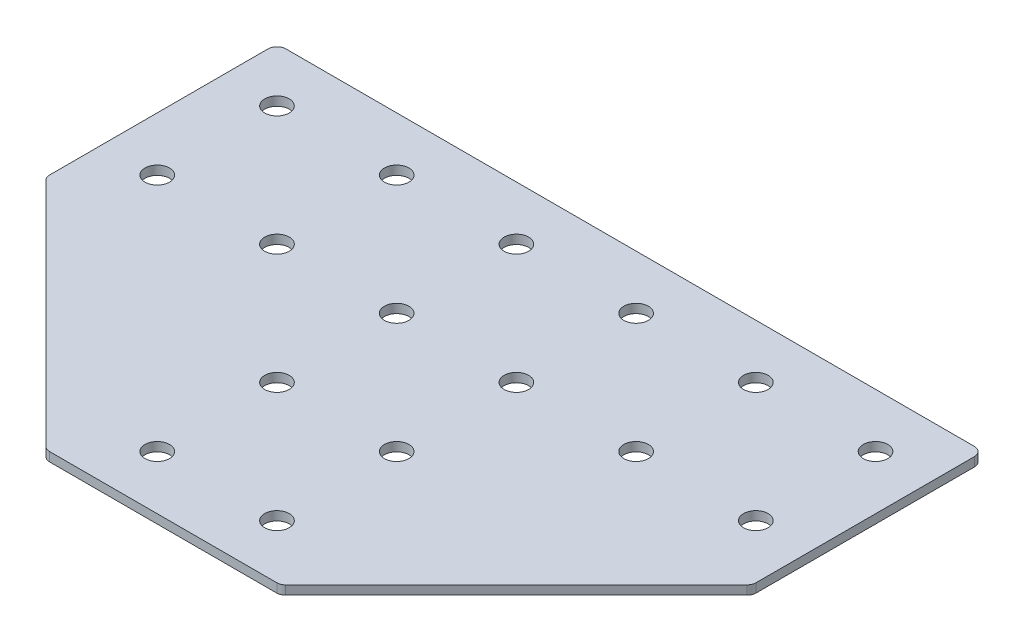
ISO-10303-21;
HEADER;
FILE_DESCRIPTION(('STEP AP214'),'2;1');
FILE_NAME('part.step','',(''),(''),'','','');
FILE_SCHEMA(('AUTOMOTIVE_DESIGN { 1 0 10303 214 1 1 1 1 }'));
ENDSEC;
DATA;
#1=APPLICATION_CONTEXT('core data for automotive mechanical design processes');
#2=APPLICATION_PROTOCOL_DEFINITION('international standard','automotive_design',2000,#1);
#3=PRODUCT_CONTEXT('',#1,'mechanical');
#4=PRODUCT('Part','Part','',(#3));
#5=PRODUCT_RELATED_PRODUCT_CATEGORY('part','',(#4));
#6=PRODUCT_DEFINITION_FORMATION('','',#4);
#7=PRODUCT_DEFINITION_CONTEXT('part definition',#1,'design');
#8=PRODUCT_DEFINITION('design','',#6,#7);
#9=PRODUCT_DEFINITION_SHAPE('','',#8);
#10=(LENGTH_UNIT() NAMED_UNIT(*) SI_UNIT(.MILLI.,.METRE.));
#11=(NAMED_UNIT(*) PLANE_ANGLE_UNIT() SI_UNIT($,.RADIAN.));
#12=(NAMED_UNIT(*) SI_UNIT($,.STERADIAN.) SOLID_ANGLE_UNIT());
#13=UNCERTAINTY_MEASURE_WITH_UNIT(LENGTH_MEASURE(1.E-05),#10,'distance_accuracy_value','');
#14=(GEOMETRIC_REPRESENTATION_CONTEXT(3) GLOBAL_UNCERTAINTY_ASSIGNED_CONTEXT((#13)) GLOBAL_UNIT_ASSIGNED_CONTEXT((#10,
#11,#12)) REPRESENTATION_CONTEXT('',''));
#15=CARTESIAN_POINT('',(0.,0.,0.));
#16=DIRECTION('',(0.,0.,1.));
#17=DIRECTION('',(1.,0.,0.));
#18=AXIS2_PLACEMENT_3D('',#15,#16,#17);
#19=CARTESIAN_POINT('',(36.9589307575042,3.99134831022957,73.4790580013509));
#20=DIRECTION('',(0.,-1.,0.));
#21=DIRECTION('',(0.,0.,-1.));
#22=AXIS2_PLACEMENT_3D('',#19,#20,#21);
#23=CYLINDRICAL_SURFACE('',#22,3.);
#24=CARTESIAN_POINT('',(36.9589307575042,0.991348310229569,73.4790580013509));
#25=DIRECTION('',(0.,-1.,0.));
#26=DIRECTION('',(0.,0.,-1.));
#27=AXIS2_PLACEMENT_3D('',#24,#25,#26);
#28=CIRCLE('',#27,3.);
#29=CARTESIAN_POINT('',(39.0802511010639,0.991348310229569,75.6003783449106));
#30=VERTEX_POINT('',#29);
#31=CARTESIAN_POINT('',(36.9589307575042,0.991348310229569,76.4790580013509));
#32=VERTEX_POINT('',#31);
#33=EDGE_CURVE('E169',#30,#32,#28,.T.);
#34=ORIENTED_EDGE('',*,*,#33,.F.);
#35=DIRECTION('',(0.,-1.,0.));
#36=VECTOR('',#35,1.);
#37=CARTESIAN_POINT('',(39.0802511010639,3.99134831022957,75.6003783449106));
#38=LINE('',#37,#36);
#39=CARTESIAN_POINT('',(39.0802511010639,3.99134831022957,75.6003783449106));
#40=VERTEX_POINT('',#39);
#41=EDGE_CURVE('E11',#40,#30,#38,.T.);
#42=ORIENTED_EDGE('',*,*,#41,.F.);
#43=CARTESIAN_POINT('',(36.9589307575042,3.99134831022957,73.4790580013509));
#44=DIRECTION('',(0.,-1.,0.));
#45=DIRECTION('',(0.,0.,-1.));
#46=AXIS2_PLACEMENT_3D('',#43,#44,#45);
#47=CIRCLE('',#46,3.);
#48=CARTESIAN_POINT('',(36.9589307575042,3.99134831022957,76.4790580013509));
#49=VERTEX_POINT('',#48);
#50=EDGE_CURVE('E214',#40,#49,#47,.T.);
#51=ORIENTED_EDGE('',*,*,#50,.T.);
#52=DIRECTION('',(0.,-1.,0.));
#53=VECTOR('',#52,1.);
#54=CARTESIAN_POINT('',(36.9589307575042,3.99134831022957,76.4790580013509));
#55=LINE('',#54,#53);
#56=EDGE_CURVE('E44',#49,#32,#55,.T.);
#57=ORIENTED_EDGE('',*,*,#56,.T.);
#58=EDGE_LOOP('',(#34,#42,#51,#57));
#59=FACE_BOUND('',#58,.T.);
#60=ADVANCED_FACE('F41',(#59),#23,.T.);
#61=CARTESIAN_POINT('',(116.151318912929,3.99134831022957,-1.47068946695478));
#62=DIRECTION('',(0.707106781186548,0.,0.707106781186547));
#63=DIRECTION('',(0.707106781186547,0.,-0.707106781186548));
#64=AXIS2_PLACEMENT_3D('',#61,#62,#63);
#65=PLANE('',#64);
#66=DIRECTION('',(-0.707106781186547,0.,0.707106781186548));
#67=VECTOR('',#66,1.);
#68=CARTESIAN_POINT('',(116.151318912929,0.991348310229569,-1.47068946695478));
#69=LINE('',#68,#67);
#70=CARTESIAN_POINT('',(116.151318912929,0.991348310229569,-1.47068946695478));
#71=VERTEX_POINT('',#70);
#72=EDGE_CURVE('E211',#71,#30,#69,.T.);
#73=ORIENTED_EDGE('',*,*,#72,.F.);
#74=DIRECTION('',(0.,-1.,0.));
#75=VECTOR('',#74,1.);
#76=CARTESIAN_POINT('',(116.151318912929,3.99134831022957,-1.47068946695478));
#77=LINE('',#76,#75);
#78=CARTESIAN_POINT('',(116.151318912929,3.99134831022957,-1.47068946695478));
#79=VERTEX_POINT('',#78);
#80=EDGE_CURVE('E51',#79,#71,#77,.T.);
#81=ORIENTED_EDGE('',*,*,#80,.F.);
#82=DIRECTION('',(-0.707106781186547,0.,0.707106781186548));
#83=VECTOR('',#82,1.);
#84=CARTESIAN_POINT('',(116.151318912929,3.99134831022957,-1.47068946695478));
#85=LINE('',#84,#83);
#86=EDGE_CURVE('E154',#79,#40,#85,.T.);
#87=ORIENTED_EDGE('',*,*,#86,.T.);
#88=ORIENTED_EDGE('',*,*,#41,.T.);
#89=EDGE_LOOP('',(#73,#81,#87,#88));
#90=FACE_BOUND('',#89,.T.);
#91=ADVANCED_FACE('F246',(#90),#65,.T.);
#92=CARTESIAN_POINT('',(114.029998569369,3.99134831022957,-3.5920098105144));
#93=DIRECTION('',(0.,-1.,0.));
#94=DIRECTION('',(0.,0.,-1.));
#95=AXIS2_PLACEMENT_3D('',#92,#93,#94);
#96=CYLINDRICAL_SURFACE('',#95,3.);
#97=CARTESIAN_POINT('',(114.029998569369,0.991348310229569,-3.5920098105144));
#98=DIRECTION('',(0.,-1.,0.));
#99=DIRECTION('',(0.,0.,-1.));
#100=AXIS2_PLACEMENT_3D('',#97,#98,#99);
#101=CIRCLE('',#100,3.);
#102=CARTESIAN_POINT('',(117.029998569369,0.991348310229569,-3.5920098105144));
#103=VERTEX_POINT('',#102);
#104=EDGE_CURVE('E140',#103,#71,#101,.T.);
#105=ORIENTED_EDGE('',*,*,#104,.F.);
#106=DIRECTION('',(0.,-1.,0.));
#107=VECTOR('',#106,1.);
#108=CARTESIAN_POINT('',(117.029998569369,3.99134831022957,-3.5920098105144));
#109=LINE('',#108,#107);
#110=CARTESIAN_POINT('',(117.029998569369,3.99134831022957,-3.5920098105144));
#111=VERTEX_POINT('',#110);
#112=EDGE_CURVE('E135',#111,#103,#109,.T.);
#113=ORIENTED_EDGE('',*,*,#112,.F.);
#114=CARTESIAN_POINT('',(114.029998569369,3.99134831022957,-3.5920098105144));
#115=DIRECTION('',(0.,-1.,0.));
#116=DIRECTION('',(0.,0.,-1.));
#117=AXIS2_PLACEMENT_3D('',#114,#115,#116);
#118=CIRCLE('',#117,3.);
#119=EDGE_CURVE('E138',#111,#79,#118,.T.);
#120=ORIENTED_EDGE('',*,*,#119,.T.);
#121=ORIENTED_EDGE('',*,*,#80,.T.);
#122=EDGE_LOOP('',(#105,#113,#120,#121));
#123=FACE_BOUND('',#122,.T.);
#124=ADVANCED_FACE('F137',(#123),#96,.T.);
#125=CARTESIAN_POINT('',(117.029998569369,3.99134831022957,-76.520941998649));
#126=DIRECTION('',(1.,0.,0.));
#127=DIRECTION('',(0.,0.,-1.));
#128=AXIS2_PLACEMENT_3D('',#125,#126,#127);
#129=PLANE('',#128);
#130=DIRECTION('',(0.,0.,1.));
#131=VECTOR('',#130,1.);
#132=CARTESIAN_POINT('',(117.029998569369,0.991348310229569,-76.520941998649));
#133=LINE('',#132,#131);
#134=CARTESIAN_POINT('',(117.029998569369,0.991348310229569,-76.520941998649));
#135=VERTEX_POINT('',#134);
#136=EDGE_CURVE('E206',#135,#103,#133,.T.);
#137=ORIENTED_EDGE('',*,*,#136,.F.);
#138=DIRECTION('',(0.,-1.,0.));
#139=VECTOR('',#138,1.);
#140=CARTESIAN_POINT('',(117.029998569369,3.99134831022957,-76.520941998649));
#141=LINE('',#140,#139);
#142=CARTESIAN_POINT('',(117.029998569369,3.99134831022957,-76.520941998649));
#143=VERTEX_POINT('',#142);
#144=EDGE_CURVE('E146',#143,#135,#141,.T.);
#145=ORIENTED_EDGE('',*,*,#144,.F.);
#146=DIRECTION('',(0.,0.,1.));
#147=VECTOR('',#146,1.);
#148=CARTESIAN_POINT('',(117.029998569369,3.99134831022957,-76.520941998649));
#149=LINE('',#148,#147);
#150=EDGE_CURVE('E152',#143,#111,#149,.T.);
#151=ORIENTED_EDGE('',*,*,#150,.T.);
#152=ORIENTED_EDGE('',*,*,#112,.T.);
#153=EDGE_LOOP('',(#137,#145,#151,#152));
#154=FACE_BOUND('',#153,.T.);
#155=ADVANCED_FACE('F157',(#154),#129,.T.);
#156=CARTESIAN_POINT('',(114.029998569369,3.99134831022957,-76.520941998649));
#157=DIRECTION('',(0.,-1.,0.));
#158=DIRECTION('',(0.,0.,-1.));
#159=AXIS2_PLACEMENT_3D('',#156,#157,#158);
#160=CYLINDRICAL_SURFACE('',#159,3.);
#161=CARTESIAN_POINT('',(114.029998569369,0.991348310229569,-76.520941998649));
#162=DIRECTION('',(0.,-1.,0.));
#163=DIRECTION('',(0.,0.,-1.));
#164=AXIS2_PLACEMENT_3D('',#161,#162,#163);
#165=CIRCLE('',#164,3.);
#166=CARTESIAN_POINT('',(114.029998569369,0.991348310229569,-79.520941998649));
#167=VERTEX_POINT('',#166);
#168=EDGE_CURVE('E202',#167,#135,#165,.T.);
#169=ORIENTED_EDGE('',*,*,#168,.F.);
#170=DIRECTION('',(0.,-1.,0.));
#171=VECTOR('',#170,1.);
#172=CARTESIAN_POINT('',(114.029998569369,3.99134831022957,-79.520941998649));
#173=LINE('',#172,#171);
#174=CARTESIAN_POINT('',(114.029998569369,3.99134831022957,-79.520941998649));
#175=VERTEX_POINT('',#174);
#176=EDGE_CURVE('E220',#175,#167,#173,.T.);
#177=ORIENTED_EDGE('',*,*,#176,.F.);
#178=CARTESIAN_POINT('',(114.029998569369,3.99134831022957,-76.520941998649));
#179=DIRECTION('',(0.,-1.,0.));
#180=DIRECTION('',(0.,0.,-1.));
#181=AXIS2_PLACEMENT_3D('',#178,#179,#180);
#182=CIRCLE('',#181,3.);
#183=EDGE_CURVE('E159',#175,#143,#182,.T.);
#184=ORIENTED_EDGE('',*,*,#183,.T.);
#185=ORIENTED_EDGE('',*,*,#144,.T.);
#186=EDGE_LOOP('',(#169,#177,#184,#185));
#187=FACE_BOUND('',#186,.T.);
#188=ADVANCED_FACE('F259',(#187),#160,.T.);
#189=CARTESIAN_POINT('',(-115.97000143063,3.99134831022957,-79.520941998649));
#190=DIRECTION('',(0.,0.,-1.));
#191=DIRECTION('',(-1.,0.,0.));
#192=AXIS2_PLACEMENT_3D('',#189,#190,#191);
#193=PLANE('',#192);
#194=DIRECTION('',(1.,0.,0.));
#195=VECTOR('',#194,1.);
#196=CARTESIAN_POINT('',(-115.97000143063,0.991348310229569,-79.520941998649));
#197=LINE('',#196,#195);
#198=CARTESIAN_POINT('',(-115.97000143063,0.991348310229569,-79.520941998649));
#199=VERTEX_POINT('',#198);
#200=EDGE_CURVE('E198',#199,#167,#197,.T.);
#201=ORIENTED_EDGE('',*,*,#200,.F.);
#202=DIRECTION('',(0.,-1.,0.));
#203=VECTOR('',#202,1.);
#204=CARTESIAN_POINT('',(-115.97000143063,3.99134831022957,-79.520941998649));
#205=LINE('',#204,#203);
#206=CARTESIAN_POINT('',(-115.97000143063,3.99134831022957,-79.520941998649));
#207=VERTEX_POINT('',#206);
#208=EDGE_CURVE('E223',#207,#199,#205,.T.);
#209=ORIENTED_EDGE('',*,*,#208,.F.);
#210=DIRECTION('',(1.,0.,0.));
#211=VECTOR('',#210,1.);
#212=CARTESIAN_POINT('',(-115.97000143063,3.99134831022957,-79.520941998649));
#213=LINE('',#212,#211);
#214=EDGE_CURVE('E163',#207,#175,#213,.T.);
#215=ORIENTED_EDGE('',*,*,#214,.T.);
#216=ORIENTED_EDGE('',*,*,#176,.T.);
#217=EDGE_LOOP('',(#201,#209,#215,#216));
#218=FACE_BOUND('',#217,.T.);
#219=ADVANCED_FACE('F262',(#218),#193,.T.);
#220=CARTESIAN_POINT('',(-115.97000143063,3.99134831022957,-76.520941998649));
#221=DIRECTION('',(0.,-1.,0.));
#222=DIRECTION('',(0.,0.,-1.));
#223=AXIS2_PLACEMENT_3D('',#220,#221,#222);
#224=CYLINDRICAL_SURFACE('',#223,3.00000000000001);
#225=CARTESIAN_POINT('',(-115.97000143063,0.991348310229569,-76.520941998649));
#226=DIRECTION('',(0.,-1.,0.));
#227=DIRECTION('',(0.,0.,-1.));
#228=AXIS2_PLACEMENT_3D('',#225,#226,#227);
#229=CIRCLE('',#228,3.00000000000001);
#230=CARTESIAN_POINT('',(-118.97000143063,0.991348310229569,-76.520941998649));
#231=VERTEX_POINT('',#230);
#232=EDGE_CURVE('E194',#231,#199,#229,.T.);
#233=ORIENTED_EDGE('',*,*,#232,.F.);
#234=DIRECTION('',(0.,-1.,0.));
#235=VECTOR('',#234,1.);
#236=CARTESIAN_POINT('',(-118.97000143063,3.99134831022957,-76.520941998649));
#237=LINE('',#236,#235);
#238=CARTESIAN_POINT('',(-118.97000143063,3.99134831022957,-76.520941998649));
#239=VERTEX_POINT('',#238);
#240=EDGE_CURVE('E226',#239,#231,#237,.T.);
#241=ORIENTED_EDGE('',*,*,#240,.F.);
#242=CARTESIAN_POINT('',(-115.97000143063,3.99134831022957,-76.520941998649));
#243=DIRECTION('',(0.,-1.,0.));
#244=DIRECTION('',(0.,0.,-1.));
#245=AXIS2_PLACEMENT_3D('',#242,#243,#244);
#246=CIRCLE('',#245,3.00000000000001);
#247=EDGE_CURVE('E515',#239,#207,#246,.T.);
#248=ORIENTED_EDGE('',*,*,#247,.T.);
#249=ORIENTED_EDGE('',*,*,#208,.T.);
#250=EDGE_LOOP('',(#233,#241,#248,#249));
#251=FACE_BOUND('',#250,.T.);
#252=ADVANCED_FACE('F266',(#251),#224,.T.);
#253=CARTESIAN_POINT('',(-118.97000143063,3.99134831022957,-3.59200981051438));
#254=DIRECTION('',(-1.,0.,0.));
#255=DIRECTION('',(0.,0.,1.));
#256=AXIS2_PLACEMENT_3D('',#253,#254,#255);
#257=PLANE('',#256);
#258=DIRECTION('',(0.,0.,-1.));
#259=VECTOR('',#258,1.);
#260=CARTESIAN_POINT('',(-118.97000143063,0.991348310229569,-3.59200981051438));
#261=LINE('',#260,#259);
#262=CARTESIAN_POINT('',(-118.97000143063,0.991348310229569,-3.59200981051438));
#263=VERTEX_POINT('',#262);
#264=EDGE_CURVE('E190',#263,#231,#261,.T.);
#265=ORIENTED_EDGE('',*,*,#264,.F.);
#266=DIRECTION('',(0.,-1.,0.));
#267=VECTOR('',#266,1.);
#268=CARTESIAN_POINT('',(-118.97000143063,3.99134831022957,-3.59200981051438));
#269=LINE('',#268,#267);
#270=CARTESIAN_POINT('',(-118.97000143063,3.99134831022957,-3.59200981051438));
#271=VERTEX_POINT('',#270);
#272=EDGE_CURVE('E229',#271,#263,#269,.T.);
#273=ORIENTED_EDGE('',*,*,#272,.F.);
#274=DIRECTION('',(0.,0.,-1.));
#275=VECTOR('',#274,1.);
#276=CARTESIAN_POINT('',(-118.97000143063,3.99134831022957,-3.59200981051438));
#277=LINE('',#276,#275);
#278=EDGE_CURVE('E511',#271,#239,#277,.T.);
#279=ORIENTED_EDGE('',*,*,#278,.T.);
#280=ORIENTED_EDGE('',*,*,#240,.T.);
#281=EDGE_LOOP('',(#265,#273,#279,#280));
#282=FACE_BOUND('',#281,.T.);
#283=ADVANCED_FACE('F270',(#282),#257,.T.);
#284=CARTESIAN_POINT('',(-115.97000143063,3.99134831022957,-3.59200981051438));
#285=DIRECTION('',(0.,-1.,0.));
#286=DIRECTION('',(0.,0.,-1.));
#287=AXIS2_PLACEMENT_3D('',#284,#285,#286);
#288=CYLINDRICAL_SURFACE('',#287,3.);
#289=CARTESIAN_POINT('',(-115.97000143063,0.991348310229569,-3.59200981051438));
#290=DIRECTION('',(0.,-1.,0.));
#291=DIRECTION('',(0.,0.,-1.));
#292=AXIS2_PLACEMENT_3D('',#289,#290,#291);
#293=CIRCLE('',#292,3.);
#294=CARTESIAN_POINT('',(-118.09132177419,0.991348310229569,-1.47068946695476));
#295=VERTEX_POINT('',#294);
#296=EDGE_CURVE('E186',#295,#263,#293,.T.);
#297=ORIENTED_EDGE('',*,*,#296,.F.);
#298=DIRECTION('',(0.,-1.,0.));
#299=VECTOR('',#298,1.);
#300=CARTESIAN_POINT('',(-118.09132177419,3.99134831022957,-1.47068946695476));
#301=LINE('',#300,#299);
#302=CARTESIAN_POINT('',(-118.09132177419,3.99134831022957,-1.47068946695476));
#303=VERTEX_POINT('',#302);
#304=EDGE_CURVE('E232',#303,#295,#301,.T.);
#305=ORIENTED_EDGE('',*,*,#304,.F.);
#306=CARTESIAN_POINT('',(-115.97000143063,3.99134831022957,-3.59200981051438));
#307=DIRECTION('',(0.,-1.,0.));
#308=DIRECTION('',(0.,0.,-1.));
#309=AXIS2_PLACEMENT_3D('',#306,#307,#308);
#310=CIRCLE('',#309,3.);
#311=EDGE_CURVE('E507',#303,#271,#310,.T.);
#312=ORIENTED_EDGE('',*,*,#311,.T.);
#313=ORIENTED_EDGE('',*,*,#272,.T.);
#314=EDGE_LOOP('',(#297,#305,#312,#313));
#315=FACE_BOUND('',#314,.T.);
#316=ADVANCED_FACE('F274',(#315),#288,.T.);
#317=CARTESIAN_POINT('',(-41.0202539623247,3.99134831022957,75.6003783449106));
#318=DIRECTION('',(-0.707106781186548,0.,0.707106781186547));
#319=DIRECTION('',(0.707106781186547,0.,0.707106781186548));
#320=AXIS2_PLACEMENT_3D('',#317,#318,#319);
#321=PLANE('',#320);
#322=DIRECTION('',(-0.707106781186547,0.,-0.707106781186548));
#323=VECTOR('',#322,1.);
#324=CARTESIAN_POINT('',(-41.0202539623247,0.991348310229569,75.6003783449106));
#325=LINE('',#324,#323);
#326=CARTESIAN_POINT('',(-41.0202539623247,0.991348310229569,75.6003783449106));
#327=VERTEX_POINT('',#326);
#328=EDGE_CURVE('E182',#327,#295,#325,.T.);
#329=ORIENTED_EDGE('',*,*,#328,.F.);
#330=DIRECTION('',(0.,-1.,0.));
#331=VECTOR('',#330,1.);
#332=CARTESIAN_POINT('',(-41.0202539623247,3.99134831022957,75.6003783449106));
#333=LINE('',#332,#331);
#334=CARTESIAN_POINT('',(-41.0202539623247,3.99134831022957,75.6003783449106));
#335=VERTEX_POINT('',#334);
#336=EDGE_CURVE('E235',#335,#327,#333,.T.);
#337=ORIENTED_EDGE('',*,*,#336,.F.);
#338=DIRECTION('',(-0.707106781186547,0.,-0.707106781186548));
#339=VECTOR('',#338,1.);
#340=CARTESIAN_POINT('',(-41.0202539623247,3.99134831022957,75.6003783449106));
#341=LINE('',#340,#339);
#342=EDGE_CURVE('E503',#335,#303,#341,.T.);
#343=ORIENTED_EDGE('',*,*,#342,.T.);
#344=ORIENTED_EDGE('',*,*,#304,.T.);
#345=EDGE_LOOP('',(#329,#337,#343,#344));
#346=FACE_BOUND('',#345,.T.);
#347=ADVANCED_FACE('F278',(#346),#321,.T.);
#348=CARTESIAN_POINT('',(-38.898933618765,3.99134831022957,73.4790580013509));
#349=DIRECTION('',(0.,-1.,0.));
#350=DIRECTION('',(0.,0.,-1.));
#351=AXIS2_PLACEMENT_3D('',#348,#349,#350);
#352=CYLINDRICAL_SURFACE('',#351,3.00000000000001);
#353=CARTESIAN_POINT('',(-38.898933618765,0.991348310229569,73.4790580013509));
#354=DIRECTION('',(0.,-1.,0.));
#355=DIRECTION('',(0.,0.,-1.));
#356=AXIS2_PLACEMENT_3D('',#353,#354,#355);
#357=CIRCLE('',#356,3.00000000000001);
#358=CARTESIAN_POINT('',(-38.898933618765,0.991348310229569,76.4790580013509));
#359=VERTEX_POINT('',#358);
#360=EDGE_CURVE('E178',#359,#327,#357,.T.);
#361=ORIENTED_EDGE('',*,*,#360,.F.);
#362=DIRECTION('',(0.,-1.,0.));
#363=VECTOR('',#362,1.);
#364=CARTESIAN_POINT('',(-38.898933618765,3.99134831022957,76.4790580013509));
#365=LINE('',#364,#363);
#366=CARTESIAN_POINT('',(-38.898933618765,3.99134831022957,76.4790580013509));
#367=VERTEX_POINT('',#366);
#368=EDGE_CURVE('E237',#367,#359,#365,.T.);
#369=ORIENTED_EDGE('',*,*,#368,.F.);
#370=CARTESIAN_POINT('',(-38.898933618765,3.99134831022957,73.4790580013509));
#371=DIRECTION('',(0.,-1.,0.));
#372=DIRECTION('',(0.,0.,-1.));
#373=AXIS2_PLACEMENT_3D('',#370,#371,#372);
#374=CIRCLE('',#373,3.00000000000001);
#375=EDGE_CURVE('E499',#367,#335,#374,.T.);
#376=ORIENTED_EDGE('',*,*,#375,.T.);
#377=ORIENTED_EDGE('',*,*,#336,.T.);
#378=EDGE_LOOP('',(#361,#369,#376,#377));
#379=FACE_BOUND('',#378,.T.);
#380=ADVANCED_FACE('F282',(#379),#352,.T.);
#381=CARTESIAN_POINT('',(36.9589307575042,3.99134831022957,76.4790580013509));
#382=DIRECTION('',(0.,0.,1.));
#383=DIRECTION('',(1.,0.,0.));
#384=AXIS2_PLACEMENT_3D('',#381,#382,#383);
#385=PLANE('',#384);
#386=DIRECTION('',(-1.,0.,0.));
#387=VECTOR('',#386,1.);
#388=CARTESIAN_POINT('',(36.9589307575042,0.991348310229569,76.4790580013509));
#389=LINE('',#388,#387);
#390=EDGE_CURVE('E173',#32,#359,#389,.T.);
#391=ORIENTED_EDGE('',*,*,#390,.F.);
#392=ORIENTED_EDGE('',*,*,#56,.F.);
#393=DIRECTION('',(-1.,0.,0.));
#394=VECTOR('',#393,1.);
#395=CARTESIAN_POINT('',(36.9589307575042,3.99134831022957,76.4790580013509));
#396=LINE('',#395,#394);
#397=EDGE_CURVE('E496',#49,#367,#396,.T.);
#398=ORIENTED_EDGE('',*,*,#397,.T.);
#399=ORIENTED_EDGE('',*,*,#368,.T.);
#400=EDGE_LOOP('',(#391,#392,#398,#399));
#401=FACE_BOUND('',#400,.T.);
#402=ADVANCED_FACE('F243',(#401),#385,.T.);
#403=CARTESIAN_POINT('',(36.9589307575042,3.99134831022957,73.4790580013509));
#404=DIRECTION('',(0.,-1.,0.));
#405=DIRECTION('',(0.,0.,-1.));
#406=AXIS2_PLACEMENT_3D('',#403,#404,#405);
#407=PLANE('',#406);
#408=CARTESIAN_POINT('',(-20.9700014306304,3.99134831022957,-61.520941998649));
#409=DIRECTION('',(0.,-1.,0.));
#410=DIRECTION('',(0.,0.,1.));
#411=AXIS2_PLACEMENT_3D('',#408,#409,#410);
#412=CIRCLE('',#411,4.1);
#413=CARTESIAN_POINT('',(-20.9700014306304,3.99134831022957,-57.420941998649));
#414=VERTEX_POINT('',#413);
#415=EDGE_CURVE('E365',#414,#414,#412,.T.);
#416=ORIENTED_EDGE('',*,*,#415,.T.);
#417=EDGE_LOOP('',(#416));
#418=FACE_BOUND('',#417,.T.);
#419=CARTESIAN_POINT('',(-60.9700014306304,3.99134831022957,-61.520941998649));
#420=DIRECTION('',(0.,-1.,0.));
#421=DIRECTION('',(0.,0.,1.));
#422=AXIS2_PLACEMENT_3D('',#419,#420,#421);
#423=CIRCLE('',#422,4.1);
#424=CARTESIAN_POINT('',(-60.9700014306304,3.99134831022957,-57.420941998649));
#425=VERTEX_POINT('',#424);
#426=EDGE_CURVE('E376',#425,#425,#423,.T.);
#427=ORIENTED_EDGE('',*,*,#426,.T.);
#428=EDGE_LOOP('',(#427));
#429=FACE_BOUND('',#428,.T.);
#430=CARTESIAN_POINT('',(-100.97000143063,3.99134831022957,-61.520941998649));
#431=DIRECTION('',(0.,-1.,0.));
#432=DIRECTION('',(0.,0.,1.));
#433=AXIS2_PLACEMENT_3D('',#430,#431,#432);
#434=CIRCLE('',#433,4.1);
#435=CARTESIAN_POINT('',(-100.97000143063,3.99134831022957,-57.420941998649));
#436=VERTEX_POINT('',#435);
#437=EDGE_CURVE('E384',#436,#436,#434,.T.);
#438=ORIENTED_EDGE('',*,*,#437,.T.);
#439=EDGE_LOOP('',(#438));
#440=FACE_BOUND('',#439,.T.);
#441=CARTESIAN_POINT('',(-20.9700014306304,3.99134831022957,-21.520941998649));
#442=DIRECTION('',(0.,-1.,0.));
#443=DIRECTION('',(0.,0.,1.));
#444=AXIS2_PLACEMENT_3D('',#441,#442,#443);
#445=CIRCLE('',#444,4.1);
#446=CARTESIAN_POINT('',(-20.9700014306304,3.99134831022957,-17.420941998649));
#447=VERTEX_POINT('',#446);
#448=EDGE_CURVE('E392',#447,#447,#445,.T.);
#449=ORIENTED_EDGE('',*,*,#448,.T.);
#450=EDGE_LOOP('',(#449));
#451=FACE_BOUND('',#450,.T.);
#452=CARTESIAN_POINT('',(-20.9700014306304,3.99134831022957,18.479058001351));
#453=DIRECTION('',(0.,-1.,0.));
#454=DIRECTION('',(0.,0.,1.));
#455=AXIS2_PLACEMENT_3D('',#452,#453,#454);
#456=CIRCLE('',#455,4.1);
#457=CARTESIAN_POINT('',(-20.9700014306304,3.99134831022957,22.579058001351));
#458=VERTEX_POINT('',#457);
#459=EDGE_CURVE('E400',#458,#458,#456,.T.);
#460=ORIENTED_EDGE('',*,*,#459,.T.);
#461=EDGE_LOOP('',(#460));
#462=FACE_BOUND('',#461,.T.);
#463=CARTESIAN_POINT('',(-20.9700014306304,3.99134831022957,58.479058001351));
#464=DIRECTION('',(0.,-1.,0.));
#465=DIRECTION('',(0.,0.,1.));
#466=AXIS2_PLACEMENT_3D('',#463,#464,#465);
#467=CIRCLE('',#466,4.10000000000001);
#468=CARTESIAN_POINT('',(-20.9700014306304,3.99134831022957,62.579058001351));
#469=VERTEX_POINT('',#468);
#470=EDGE_CURVE('E408',#469,#469,#467,.T.);
#471=ORIENTED_EDGE('',*,*,#470,.T.);
#472=EDGE_LOOP('',(#471));
#473=FACE_BOUND('',#472,.T.);
#474=CARTESIAN_POINT('',(-60.9700014306304,3.99134831022957,-21.520941998649));
#475=DIRECTION('',(0.,-1.,0.));
#476=DIRECTION('',(0.,0.,1.));
#477=AXIS2_PLACEMENT_3D('',#474,#475,#476);
#478=CIRCLE('',#477,4.1);
#479=CARTESIAN_POINT('',(-60.9700014306304,3.99134831022957,-17.420941998649));
#480=VERTEX_POINT('',#479);
#481=EDGE_CURVE('E416',#480,#480,#478,.T.);
#482=ORIENTED_EDGE('',*,*,#481,.T.);
#483=EDGE_LOOP('',(#482));
#484=FACE_BOUND('',#483,.T.);
#485=CARTESIAN_POINT('',(-100.97000143063,3.99134831022957,-21.520941998649));
#486=DIRECTION('',(0.,-1.,0.));
#487=DIRECTION('',(0.,0.,1.));
#488=AXIS2_PLACEMENT_3D('',#485,#486,#487);
#489=CIRCLE('',#488,4.1);
#490=CARTESIAN_POINT('',(-100.97000143063,3.99134831022957,-17.420941998649));
#491=VERTEX_POINT('',#490);
#492=EDGE_CURVE('E424',#491,#491,#489,.T.);
#493=ORIENTED_EDGE('',*,*,#492,.T.);
#494=EDGE_LOOP('',(#493));
#495=FACE_BOUND('',#494,.T.);
#496=CARTESIAN_POINT('',(19.0299985693696,3.99134831022957,-61.520941998649));
#497=DIRECTION('',(0.,-1.,0.));
#498=DIRECTION('',(0.,0.,1.));
#499=AXIS2_PLACEMENT_3D('',#496,#497,#498);
#500=CIRCLE('',#499,4.1);
#501=CARTESIAN_POINT('',(19.0299985693696,3.99134831022957,-57.420941998649));
#502=VERTEX_POINT('',#501);
#503=EDGE_CURVE('E432',#502,#502,#500,.T.);
#504=ORIENTED_EDGE('',*,*,#503,.T.);
#505=EDGE_LOOP('',(#504));
#506=FACE_BOUND('',#505,.T.);
#507=CARTESIAN_POINT('',(59.0299985693696,3.99134831022957,-61.520941998649));
#508=DIRECTION('',(0.,-1.,0.));
#509=DIRECTION('',(0.,0.,1.));
#510=AXIS2_PLACEMENT_3D('',#507,#508,#509);
#511=CIRCLE('',#510,4.1);
#512=CARTESIAN_POINT('',(59.0299985693696,3.99134831022957,-57.420941998649));
#513=VERTEX_POINT('',#512);
#514=EDGE_CURVE('E440',#513,#513,#511,.T.);
#515=ORIENTED_EDGE('',*,*,#514,.T.);
#516=EDGE_LOOP('',(#515));
#517=FACE_BOUND('',#516,.T.);
#518=CARTESIAN_POINT('',(99.0299985693696,3.99134831022957,-61.520941998649));
#519=DIRECTION('',(0.,-1.,0.));
#520=DIRECTION('',(0.,0.,1.));
#521=AXIS2_PLACEMENT_3D('',#518,#519,#520);
#522=CIRCLE('',#521,4.1);
#523=CARTESIAN_POINT('',(99.0299985693696,3.99134831022957,-57.420941998649));
#524=VERTEX_POINT('',#523);
#525=EDGE_CURVE('E448',#524,#524,#522,.T.);
#526=ORIENTED_EDGE('',*,*,#525,.T.);
#527=EDGE_LOOP('',(#526));
#528=FACE_BOUND('',#527,.T.);
#529=CARTESIAN_POINT('',(19.0299985693696,3.99134831022957,-21.520941998649));
#530=DIRECTION('',(0.,-1.,0.));
#531=DIRECTION('',(0.,0.,1.));
#532=AXIS2_PLACEMENT_3D('',#529,#530,#531);
#533=CIRCLE('',#532,4.1);
#534=CARTESIAN_POINT('',(19.0299985693696,3.99134831022957,-17.420941998649));
#535=VERTEX_POINT('',#534);
#536=EDGE_CURVE('E456',#535,#535,#533,.T.);
#537=ORIENTED_EDGE('',*,*,#536,.T.);
#538=EDGE_LOOP('',(#537));
#539=FACE_BOUND('',#538,.T.);
#540=CARTESIAN_POINT('',(19.0299985693696,3.99134831022957,18.479058001351));
#541=DIRECTION('',(0.,-1.,0.));
#542=DIRECTION('',(0.,0.,1.));
#543=AXIS2_PLACEMENT_3D('',#540,#541,#542);
#544=CIRCLE('',#543,4.1);
#545=CARTESIAN_POINT('',(19.0299985693696,3.99134831022957,22.579058001351));
#546=VERTEX_POINT('',#545);
#547=EDGE_CURVE('E464',#546,#546,#544,.T.);
#548=ORIENTED_EDGE('',*,*,#547,.T.);
#549=EDGE_LOOP('',(#548));
#550=FACE_BOUND('',#549,.T.);
#551=CARTESIAN_POINT('',(19.0299985693696,3.99134831022957,58.479058001351));
#552=DIRECTION('',(0.,-1.,0.));
#553=DIRECTION('',(0.,0.,1.));
#554=AXIS2_PLACEMENT_3D('',#551,#552,#553);
#555=CIRCLE('',#554,4.10000000000001);
#556=CARTESIAN_POINT('',(19.0299985693696,3.99134831022957,62.579058001351));
#557=VERTEX_POINT('',#556);
#558=EDGE_CURVE('E472',#557,#557,#555,.T.);
#559=ORIENTED_EDGE('',*,*,#558,.T.);
#560=EDGE_LOOP('',(#559));
#561=FACE_BOUND('',#560,.T.);
#562=CARTESIAN_POINT('',(59.0299985693696,3.99134831022957,-21.520941998649));
#563=DIRECTION('',(0.,-1.,0.));
#564=DIRECTION('',(0.,0.,1.));
#565=AXIS2_PLACEMENT_3D('',#562,#563,#564);
#566=CIRCLE('',#565,4.1);
#567=CARTESIAN_POINT('',(59.0299985693696,3.99134831022957,-17.420941998649));
#568=VERTEX_POINT('',#567);
#569=EDGE_CURVE('E480',#568,#568,#566,.T.);
#570=ORIENTED_EDGE('',*,*,#569,.T.);
#571=EDGE_LOOP('',(#570));
#572=FACE_BOUND('',#571,.T.);
#573=CARTESIAN_POINT('',(99.0299985693696,3.99134831022957,-21.520941998649));
#574=DIRECTION('',(0.,-1.,0.));
#575=DIRECTION('',(0.,0.,1.));
#576=AXIS2_PLACEMENT_3D('',#573,#574,#575);
#577=CIRCLE('',#576,4.1);
#578=CARTESIAN_POINT('',(99.0299985693696,3.99134831022957,-17.420941998649));
#579=VERTEX_POINT('',#578);
#580=EDGE_CURVE('E174',#579,#579,#577,.T.);
#581=ORIENTED_EDGE('',*,*,#580,.T.);
#582=EDGE_LOOP('',(#581));
#583=FACE_BOUND('',#582,.T.);
#584=ORIENTED_EDGE('',*,*,#50,.F.);
#585=ORIENTED_EDGE('',*,*,#86,.F.);
#586=ORIENTED_EDGE('',*,*,#119,.F.);
#587=ORIENTED_EDGE('',*,*,#150,.F.);
#588=ORIENTED_EDGE('',*,*,#183,.F.);
#589=ORIENTED_EDGE('',*,*,#214,.F.);
#590=ORIENTED_EDGE('',*,*,#247,.F.);
#591=ORIENTED_EDGE('',*,*,#278,.F.);
#592=ORIENTED_EDGE('',*,*,#311,.F.);
#593=ORIENTED_EDGE('',*,*,#342,.F.);
#594=ORIENTED_EDGE('',*,*,#375,.F.);
#595=ORIENTED_EDGE('',*,*,#397,.F.);
#596=EDGE_LOOP('',(#584,#585,#586,#587,#588,#589,#590,#591,#592,#593,#594,#595));
#597=FACE_BOUND('',#596,.T.);
#598=ADVANCED_FACE('F150',(#418,#429,#440,#451,#462,#473,#484,#495,#506,#517,#528,#539,#550,
#561,#572,#583,#597),#407,.F.);
#599=CARTESIAN_POINT('',(36.9589307575042,0.991348310229569,73.4790580013509));
#600=DIRECTION('',(0.,-1.,0.));
#601=DIRECTION('',(0.,0.,-1.));
#602=AXIS2_PLACEMENT_3D('',#599,#600,#601);
#603=PLANE('',#602);
#604=CARTESIAN_POINT('',(-20.9700014306304,0.991348310229569,-61.520941998649));
#605=DIRECTION('',(0.,-1.,0.));
#606=DIRECTION('',(0.,0.,1.));
#607=AXIS2_PLACEMENT_3D('',#604,#605,#606);
#608=CIRCLE('',#607,4.1);
#609=CARTESIAN_POINT('',(-20.9700014306304,0.991348310229569,-57.420941998649));
#610=VERTEX_POINT('',#609);
#611=EDGE_CURVE('E368',#610,#610,#608,.T.);
#612=ORIENTED_EDGE('',*,*,#611,.F.);
#613=EDGE_LOOP('',(#612));
#614=FACE_BOUND('',#613,.T.);
#615=CARTESIAN_POINT('',(-60.9700014306304,0.991348310229569,-61.520941998649));
#616=DIRECTION('',(0.,-1.,0.));
#617=DIRECTION('',(0.,0.,1.));
#618=AXIS2_PLACEMENT_3D('',#615,#616,#617);
#619=CIRCLE('',#618,4.1);
#620=CARTESIAN_POINT('',(-60.9700014306304,0.991348310229569,-57.420941998649));
#621=VERTEX_POINT('',#620);
#622=EDGE_CURVE('E373',#621,#621,#619,.T.);
#623=ORIENTED_EDGE('',*,*,#622,.F.);
#624=EDGE_LOOP('',(#623));
#625=FACE_BOUND('',#624,.T.);
#626=CARTESIAN_POINT('',(-100.97000143063,0.991348310229569,-61.520941998649));
#627=DIRECTION('',(0.,-1.,0.));
#628=DIRECTION('',(0.,0.,1.));
#629=AXIS2_PLACEMENT_3D('',#626,#627,#628);
#630=CIRCLE('',#629,4.1);
#631=CARTESIAN_POINT('',(-100.97000143063,0.991348310229569,-57.420941998649));
#632=VERTEX_POINT('',#631);
#633=EDGE_CURVE('E380',#632,#632,#630,.T.);
#634=ORIENTED_EDGE('',*,*,#633,.F.);
#635=EDGE_LOOP('',(#634));
#636=FACE_BOUND('',#635,.T.);
#637=CARTESIAN_POINT('',(-20.9700014306304,0.991348310229569,-21.520941998649));
#638=DIRECTION('',(0.,-1.,0.));
#639=DIRECTION('',(0.,0.,1.));
#640=AXIS2_PLACEMENT_3D('',#637,#638,#639);
#641=CIRCLE('',#640,4.1);
#642=CARTESIAN_POINT('',(-20.9700014306304,0.991348310229569,-17.420941998649));
#643=VERTEX_POINT('',#642);
#644=EDGE_CURVE('E388',#643,#643,#641,.T.);
#645=ORIENTED_EDGE('',*,*,#644,.F.);
#646=EDGE_LOOP('',(#645));
#647=FACE_BOUND('',#646,.T.);
#648=CARTESIAN_POINT('',(-20.9700014306304,0.991348310229569,18.479058001351));
#649=DIRECTION('',(0.,-1.,0.));
#650=DIRECTION('',(0.,0.,1.));
#651=AXIS2_PLACEMENT_3D('',#648,#649,#650);
#652=CIRCLE('',#651,4.1);
#653=CARTESIAN_POINT('',(-20.9700014306304,0.991348310229569,22.579058001351));
#654=VERTEX_POINT('',#653);
#655=EDGE_CURVE('E396',#654,#654,#652,.T.);
#656=ORIENTED_EDGE('',*,*,#655,.F.);
#657=EDGE_LOOP('',(#656));
#658=FACE_BOUND('',#657,.T.);
#659=CARTESIAN_POINT('',(-20.9700014306304,0.991348310229569,58.479058001351));
#660=DIRECTION('',(0.,-1.,0.));
#661=DIRECTION('',(0.,0.,1.));
#662=AXIS2_PLACEMENT_3D('',#659,#660,#661);
#663=CIRCLE('',#662,4.10000000000001);
#664=CARTESIAN_POINT('',(-20.9700014306304,0.991348310229569,62.579058001351));
#665=VERTEX_POINT('',#664);
#666=EDGE_CURVE('E404',#665,#665,#663,.T.);
#667=ORIENTED_EDGE('',*,*,#666,.F.);
#668=EDGE_LOOP('',(#667));
#669=FACE_BOUND('',#668,.T.);
#670=CARTESIAN_POINT('',(-60.9700014306304,0.991348310229569,-21.520941998649));
#671=DIRECTION('',(0.,-1.,0.));
#672=DIRECTION('',(0.,0.,1.));
#673=AXIS2_PLACEMENT_3D('',#670,#671,#672);
#674=CIRCLE('',#673,4.1);
#675=CARTESIAN_POINT('',(-60.9700014306304,0.991348310229569,-17.420941998649));
#676=VERTEX_POINT('',#675);
#677=EDGE_CURVE('E412',#676,#676,#674,.T.);
#678=ORIENTED_EDGE('',*,*,#677,.F.);
#679=EDGE_LOOP('',(#678));
#680=FACE_BOUND('',#679,.T.);
#681=CARTESIAN_POINT('',(-100.97000143063,0.991348310229569,-21.520941998649));
#682=DIRECTION('',(0.,-1.,0.));
#683=DIRECTION('',(0.,0.,1.));
#684=AXIS2_PLACEMENT_3D('',#681,#682,#683);
#685=CIRCLE('',#684,4.1);
#686=CARTESIAN_POINT('',(-100.97000143063,0.991348310229569,-17.420941998649));
#687=VERTEX_POINT('',#686);
#688=EDGE_CURVE('E420',#687,#687,#685,.T.);
#689=ORIENTED_EDGE('',*,*,#688,.F.);
#690=EDGE_LOOP('',(#689));
#691=FACE_BOUND('',#690,.T.);
#692=CARTESIAN_POINT('',(19.0299985693696,0.991348310229569,-61.520941998649));
#693=DIRECTION('',(0.,-1.,0.));
#694=DIRECTION('',(0.,0.,1.));
#695=AXIS2_PLACEMENT_3D('',#692,#693,#694);
#696=CIRCLE('',#695,4.1);
#697=CARTESIAN_POINT('',(19.0299985693696,0.991348310229569,-57.420941998649));
#698=VERTEX_POINT('',#697);
#699=EDGE_CURVE('E428',#698,#698,#696,.T.);
#700=ORIENTED_EDGE('',*,*,#699,.F.);
#701=EDGE_LOOP('',(#700));
#702=FACE_BOUND('',#701,.T.);
#703=CARTESIAN_POINT('',(59.0299985693696,0.991348310229569,-61.520941998649));
#704=DIRECTION('',(0.,-1.,0.));
#705=DIRECTION('',(0.,0.,1.));
#706=AXIS2_PLACEMENT_3D('',#703,#704,#705);
#707=CIRCLE('',#706,4.1);
#708=CARTESIAN_POINT('',(59.0299985693696,0.991348310229569,-57.420941998649));
#709=VERTEX_POINT('',#708);
#710=EDGE_CURVE('E436',#709,#709,#707,.T.);
#711=ORIENTED_EDGE('',*,*,#710,.F.);
#712=EDGE_LOOP('',(#711));
#713=FACE_BOUND('',#712,.T.);
#714=CARTESIAN_POINT('',(99.0299985693696,0.991348310229569,-61.520941998649));
#715=DIRECTION('',(0.,-1.,0.));
#716=DIRECTION('',(0.,0.,1.));
#717=AXIS2_PLACEMENT_3D('',#714,#715,#716);
#718=CIRCLE('',#717,4.1);
#719=CARTESIAN_POINT('',(99.0299985693696,0.991348310229569,-57.420941998649));
#720=VERTEX_POINT('',#719);
#721=EDGE_CURVE('E444',#720,#720,#718,.T.);
#722=ORIENTED_EDGE('',*,*,#721,.F.);
#723=EDGE_LOOP('',(#722));
#724=FACE_BOUND('',#723,.T.);
#725=CARTESIAN_POINT('',(19.0299985693696,0.991348310229569,-21.520941998649));
#726=DIRECTION('',(0.,-1.,0.));
#727=DIRECTION('',(0.,0.,1.));
#728=AXIS2_PLACEMENT_3D('',#725,#726,#727);
#729=CIRCLE('',#728,4.1);
#730=CARTESIAN_POINT('',(19.0299985693696,0.991348310229569,-17.420941998649));
#731=VERTEX_POINT('',#730);
#732=EDGE_CURVE('E452',#731,#731,#729,.T.);
#733=ORIENTED_EDGE('',*,*,#732,.F.);
#734=EDGE_LOOP('',(#733));
#735=FACE_BOUND('',#734,.T.);
#736=CARTESIAN_POINT('',(19.0299985693696,0.991348310229569,18.479058001351));
#737=DIRECTION('',(0.,-1.,0.));
#738=DIRECTION('',(0.,0.,1.));
#739=AXIS2_PLACEMENT_3D('',#736,#737,#738);
#740=CIRCLE('',#739,4.1);
#741=CARTESIAN_POINT('',(19.0299985693696,0.991348310229569,22.579058001351));
#742=VERTEX_POINT('',#741);
#743=EDGE_CURVE('E460',#742,#742,#740,.T.);
#744=ORIENTED_EDGE('',*,*,#743,.F.);
#745=EDGE_LOOP('',(#744));
#746=FACE_BOUND('',#745,.T.);
#747=CARTESIAN_POINT('',(19.0299985693696,0.991348310229569,58.479058001351));
#748=DIRECTION('',(0.,-1.,0.));
#749=DIRECTION('',(0.,0.,1.));
#750=AXIS2_PLACEMENT_3D('',#747,#748,#749);
#751=CIRCLE('',#750,4.10000000000001);
#752=CARTESIAN_POINT('',(19.0299985693696,0.991348310229569,62.579058001351));
#753=VERTEX_POINT('',#752);
#754=EDGE_CURVE('E468',#753,#753,#751,.T.);
#755=ORIENTED_EDGE('',*,*,#754,.F.);
#756=EDGE_LOOP('',(#755));
#757=FACE_BOUND('',#756,.T.);
#758=CARTESIAN_POINT('',(59.0299985693696,0.991348310229569,-21.520941998649));
#759=DIRECTION('',(0.,-1.,0.));
#760=DIRECTION('',(0.,0.,1.));
#761=AXIS2_PLACEMENT_3D('',#758,#759,#760);
#762=CIRCLE('',#761,4.1);
#763=CARTESIAN_POINT('',(59.0299985693696,0.991348310229569,-17.420941998649));
#764=VERTEX_POINT('',#763);
#765=EDGE_CURVE('E476',#764,#764,#762,.T.);
#766=ORIENTED_EDGE('',*,*,#765,.F.);
#767=EDGE_LOOP('',(#766));
#768=FACE_BOUND('',#767,.T.);
#769=CARTESIAN_POINT('',(99.0299985693696,0.991348310229569,-21.520941998649));
#770=DIRECTION('',(0.,-1.,0.));
#771=DIRECTION('',(0.,0.,1.));
#772=AXIS2_PLACEMENT_3D('',#769,#770,#771);
#773=CIRCLE('',#772,4.1);
#774=CARTESIAN_POINT('',(99.0299985693696,0.991348310229569,-17.420941998649));
#775=VERTEX_POINT('',#774);
#776=EDGE_CURVE('E484',#775,#775,#773,.T.);
#777=ORIENTED_EDGE('',*,*,#776,.F.);
#778=EDGE_LOOP('',(#777));
#779=FACE_BOUND('',#778,.T.);
#780=ORIENTED_EDGE('',*,*,#33,.T.);
#781=ORIENTED_EDGE('',*,*,#390,.T.);
#782=ORIENTED_EDGE('',*,*,#360,.T.);
#783=ORIENTED_EDGE('',*,*,#328,.T.);
#784=ORIENTED_EDGE('',*,*,#296,.T.);
#785=ORIENTED_EDGE('',*,*,#264,.T.);
#786=ORIENTED_EDGE('',*,*,#232,.T.);
#787=ORIENTED_EDGE('',*,*,#200,.T.);
#788=ORIENTED_EDGE('',*,*,#168,.T.);
#789=ORIENTED_EDGE('',*,*,#136,.T.);
#790=ORIENTED_EDGE('',*,*,#104,.T.);
#791=ORIENTED_EDGE('',*,*,#72,.T.);
#792=EDGE_LOOP('',(#780,#781,#782,#783,#784,#785,#786,#787,#788,#789,#790,#791));
#793=FACE_BOUND('',#792,.T.);
#794=ADVANCED_FACE('F245',(#614,#625,#636,#647,#658,#669,#680,#691,#702,#713,#724,#735,#746,
#757,#768,#779,#793),#603,.T.);
#795=CARTESIAN_POINT('',(99.0299985693696,3.99134831022957,-21.520941998649));
#796=DIRECTION('',(0.,-1.,0.));
#797=DIRECTION('',(0.,0.,-1.));
#798=AXIS2_PLACEMENT_3D('',#795,#796,#797);
#799=CYLINDRICAL_SURFACE('',#798,4.1);
#800=ORIENTED_EDGE('',*,*,#580,.F.);
#801=EDGE_LOOP('',(#800));
#802=FACE_BOUND('',#801,.T.);
#803=ORIENTED_EDGE('',*,*,#776,.T.);
#804=EDGE_LOOP('',(#803));
#805=FACE_BOUND('',#804,.T.);
#806=ADVANCED_FACE('F294',(#802,#805),#799,.F.);
#807=CARTESIAN_POINT('',(59.0299985693696,3.99134831022957,-21.520941998649));
#808=DIRECTION('',(0.,-1.,0.));
#809=DIRECTION('',(0.,0.,-1.));
#810=AXIS2_PLACEMENT_3D('',#807,#808,#809);
#811=CYLINDRICAL_SURFACE('',#810,4.1);
#812=ORIENTED_EDGE('',*,*,#569,.F.);
#813=EDGE_LOOP('',(#812));
#814=FACE_BOUND('',#813,.T.);
#815=ORIENTED_EDGE('',*,*,#765,.T.);
#816=EDGE_LOOP('',(#815));
#817=FACE_BOUND('',#816,.T.);
#818=ADVANCED_FACE('F301',(#814,#817),#811,.F.);
#819=CARTESIAN_POINT('',(19.0299985693696,3.99134831022957,58.479058001351));
#820=DIRECTION('',(0.,-1.,0.));
#821=DIRECTION('',(0.,0.,-1.));
#822=AXIS2_PLACEMENT_3D('',#819,#820,#821);
#823=CYLINDRICAL_SURFACE('',#822,4.10000000000001);
#824=ORIENTED_EDGE('',*,*,#558,.F.);
#825=EDGE_LOOP('',(#824));
#826=FACE_BOUND('',#825,.T.);
#827=ORIENTED_EDGE('',*,*,#754,.T.);
#828=EDGE_LOOP('',(#827));
#829=FACE_BOUND('',#828,.T.);
#830=ADVANCED_FACE('F305',(#826,#829),#823,.F.);
#831=CARTESIAN_POINT('',(19.0299985693696,3.99134831022957,18.479058001351));
#832=DIRECTION('',(0.,-1.,0.));
#833=DIRECTION('',(0.,0.,-1.));
#834=AXIS2_PLACEMENT_3D('',#831,#832,#833);
#835=CYLINDRICAL_SURFACE('',#834,4.1);
#836=ORIENTED_EDGE('',*,*,#547,.F.);
#837=EDGE_LOOP('',(#836));
#838=FACE_BOUND('',#837,.T.);
#839=ORIENTED_EDGE('',*,*,#743,.T.);
#840=EDGE_LOOP('',(#839));
#841=FACE_BOUND('',#840,.T.);
#842=ADVANCED_FACE('F309',(#838,#841),#835,.F.);
#843=CARTESIAN_POINT('',(19.0299985693696,3.99134831022957,-21.520941998649));
#844=DIRECTION('',(0.,-1.,0.));
#845=DIRECTION('',(0.,0.,-1.));
#846=AXIS2_PLACEMENT_3D('',#843,#844,#845);
#847=CYLINDRICAL_SURFACE('',#846,4.1);
#848=ORIENTED_EDGE('',*,*,#536,.F.);
#849=EDGE_LOOP('',(#848));
#850=FACE_BOUND('',#849,.T.);
#851=ORIENTED_EDGE('',*,*,#732,.T.);
#852=EDGE_LOOP('',(#851));
#853=FACE_BOUND('',#852,.T.);
#854=ADVANCED_FACE('F313',(#850,#853),#847,.F.);
#855=CARTESIAN_POINT('',(99.0299985693696,3.99134831022957,-61.520941998649));
#856=DIRECTION('',(0.,-1.,0.));
#857=DIRECTION('',(0.,0.,-1.));
#858=AXIS2_PLACEMENT_3D('',#855,#856,#857);
#859=CYLINDRICAL_SURFACE('',#858,4.1);
#860=ORIENTED_EDGE('',*,*,#525,.F.);
#861=EDGE_LOOP('',(#860));
#862=FACE_BOUND('',#861,.T.);
#863=ORIENTED_EDGE('',*,*,#721,.T.);
#864=EDGE_LOOP('',(#863));
#865=FACE_BOUND('',#864,.T.);
#866=ADVANCED_FACE('F317',(#862,#865),#859,.F.);
#867=CARTESIAN_POINT('',(59.0299985693696,3.99134831022957,-61.520941998649));
#868=DIRECTION('',(0.,-1.,0.));
#869=DIRECTION('',(0.,0.,-1.));
#870=AXIS2_PLACEMENT_3D('',#867,#868,#869);
#871=CYLINDRICAL_SURFACE('',#870,4.1);
#872=ORIENTED_EDGE('',*,*,#514,.F.);
#873=EDGE_LOOP('',(#872));
#874=FACE_BOUND('',#873,.T.);
#875=ORIENTED_EDGE('',*,*,#710,.T.);
#876=EDGE_LOOP('',(#875));
#877=FACE_BOUND('',#876,.T.);
#878=ADVANCED_FACE('F321',(#874,#877),#871,.F.);
#879=CARTESIAN_POINT('',(19.0299985693696,3.99134831022957,-61.520941998649));
#880=DIRECTION('',(0.,-1.,0.));
#881=DIRECTION('',(0.,0.,-1.));
#882=AXIS2_PLACEMENT_3D('',#879,#880,#881);
#883=CYLINDRICAL_SURFACE('',#882,4.1);
#884=ORIENTED_EDGE('',*,*,#503,.F.);
#885=EDGE_LOOP('',(#884));
#886=FACE_BOUND('',#885,.T.);
#887=ORIENTED_EDGE('',*,*,#699,.T.);
#888=EDGE_LOOP('',(#887));
#889=FACE_BOUND('',#888,.T.);
#890=ADVANCED_FACE('F325',(#886,#889),#883,.F.);
#891=CARTESIAN_POINT('',(-100.97000143063,3.99134831022957,-21.520941998649));
#892=DIRECTION('',(0.,-1.,0.));
#893=DIRECTION('',(0.,0.,-1.));
#894=AXIS2_PLACEMENT_3D('',#891,#892,#893);
#895=CYLINDRICAL_SURFACE('',#894,4.1);
#896=ORIENTED_EDGE('',*,*,#492,.F.);
#897=EDGE_LOOP('',(#896));
#898=FACE_BOUND('',#897,.T.);
#899=ORIENTED_EDGE('',*,*,#688,.T.);
#900=EDGE_LOOP('',(#899));
#901=FACE_BOUND('',#900,.T.);
#902=ADVANCED_FACE('F329',(#898,#901),#895,.F.);
#903=CARTESIAN_POINT('',(-60.9700014306304,3.99134831022957,-21.520941998649));
#904=DIRECTION('',(0.,-1.,0.));
#905=DIRECTION('',(0.,0.,-1.));
#906=AXIS2_PLACEMENT_3D('',#903,#904,#905);
#907=CYLINDRICAL_SURFACE('',#906,4.1);
#908=ORIENTED_EDGE('',*,*,#481,.F.);
#909=EDGE_LOOP('',(#908));
#910=FACE_BOUND('',#909,.T.);
#911=ORIENTED_EDGE('',*,*,#677,.T.);
#912=EDGE_LOOP('',(#911));
#913=FACE_BOUND('',#912,.T.);
#914=ADVANCED_FACE('F333',(#910,#913),#907,.F.);
#915=CARTESIAN_POINT('',(-20.9700014306304,3.99134831022957,58.479058001351));
#916=DIRECTION('',(0.,-1.,0.));
#917=DIRECTION('',(0.,0.,-1.));
#918=AXIS2_PLACEMENT_3D('',#915,#916,#917);
#919=CYLINDRICAL_SURFACE('',#918,4.10000000000001);
#920=ORIENTED_EDGE('',*,*,#470,.F.);
#921=EDGE_LOOP('',(#920));
#922=FACE_BOUND('',#921,.T.);
#923=ORIENTED_EDGE('',*,*,#666,.T.);
#924=EDGE_LOOP('',(#923));
#925=FACE_BOUND('',#924,.T.);
#926=ADVANCED_FACE('F337',(#922,#925),#919,.F.);
#927=CARTESIAN_POINT('',(-20.9700014306304,3.99134831022957,18.479058001351));
#928=DIRECTION('',(0.,-1.,0.));
#929=DIRECTION('',(0.,0.,-1.));
#930=AXIS2_PLACEMENT_3D('',#927,#928,#929);
#931=CYLINDRICAL_SURFACE('',#930,4.1);
#932=ORIENTED_EDGE('',*,*,#459,.F.);
#933=EDGE_LOOP('',(#932));
#934=FACE_BOUND('',#933,.T.);
#935=ORIENTED_EDGE('',*,*,#655,.T.);
#936=EDGE_LOOP('',(#935));
#937=FACE_BOUND('',#936,.T.);
#938=ADVANCED_FACE('F341',(#934,#937),#931,.F.);
#939=CARTESIAN_POINT('',(-20.9700014306304,3.99134831022957,-21.520941998649));
#940=DIRECTION('',(0.,-1.,0.));
#941=DIRECTION('',(0.,0.,-1.));
#942=AXIS2_PLACEMENT_3D('',#939,#940,#941);
#943=CYLINDRICAL_SURFACE('',#942,4.1);
#944=ORIENTED_EDGE('',*,*,#448,.F.);
#945=EDGE_LOOP('',(#944));
#946=FACE_BOUND('',#945,.T.);
#947=ORIENTED_EDGE('',*,*,#644,.T.);
#948=EDGE_LOOP('',(#947));
#949=FACE_BOUND('',#948,.T.);
#950=ADVANCED_FACE('F345',(#946,#949),#943,.F.);
#951=CARTESIAN_POINT('',(-100.97000143063,3.99134831022957,-61.520941998649));
#952=DIRECTION('',(0.,-1.,0.));
#953=DIRECTION('',(0.,0.,-1.));
#954=AXIS2_PLACEMENT_3D('',#951,#952,#953);
#955=CYLINDRICAL_SURFACE('',#954,4.1);
#956=ORIENTED_EDGE('',*,*,#437,.F.);
#957=EDGE_LOOP('',(#956));
#958=FACE_BOUND('',#957,.T.);
#959=ORIENTED_EDGE('',*,*,#633,.T.);
#960=EDGE_LOOP('',(#959));
#961=FACE_BOUND('',#960,.T.);
#962=ADVANCED_FACE('F349',(#958,#961),#955,.F.);
#963=CARTESIAN_POINT('',(-60.9700014306304,3.99134831022957,-61.520941998649));
#964=DIRECTION('',(0.,-1.,0.));
#965=DIRECTION('',(0.,0.,-1.));
#966=AXIS2_PLACEMENT_3D('',#963,#964,#965);
#967=CYLINDRICAL_SURFACE('',#966,4.1);
#968=ORIENTED_EDGE('',*,*,#426,.F.);
#969=EDGE_LOOP('',(#968));
#970=FACE_BOUND('',#969,.T.);
#971=ORIENTED_EDGE('',*,*,#622,.T.);
#972=EDGE_LOOP('',(#971));
#973=FACE_BOUND('',#972,.T.);
#974=ADVANCED_FACE('F353',(#970,#973),#967,.F.);
#975=CARTESIAN_POINT('',(-20.9700014306304,3.99134831022957,-61.520941998649));
#976=DIRECTION('',(0.,-1.,0.));
#977=DIRECTION('',(0.,0.,-1.));
#978=AXIS2_PLACEMENT_3D('',#975,#976,#977);
#979=CYLINDRICAL_SURFACE('',#978,4.1);
#980=ORIENTED_EDGE('',*,*,#415,.F.);
#981=EDGE_LOOP('',(#980));
#982=FACE_BOUND('',#981,.T.);
#983=ORIENTED_EDGE('',*,*,#611,.T.);
#984=EDGE_LOOP('',(#983));
#985=FACE_BOUND('',#984,.T.);
#986=ADVANCED_FACE('F357',(#982,#985),#979,.F.);
#987=CLOSED_SHELL('',(#60,#91,#124,#155,#188,#219,#252,#283,#316,#347,#380,#402,#598,#794,#806,
#818,#830,#842,#854,#866,#878,#890,#902,#914,#926,#938,#950,#962,#974,#986));
#988=MANIFOLD_SOLID_BREP('B2',#987);
#989=ADVANCED_BREP_SHAPE_REPRESENTATION('',(#18,#988),#14);
#990=SHAPE_DEFINITION_REPRESENTATION(#9,#989);
ENDSEC;
END-ISO-10303-21;
